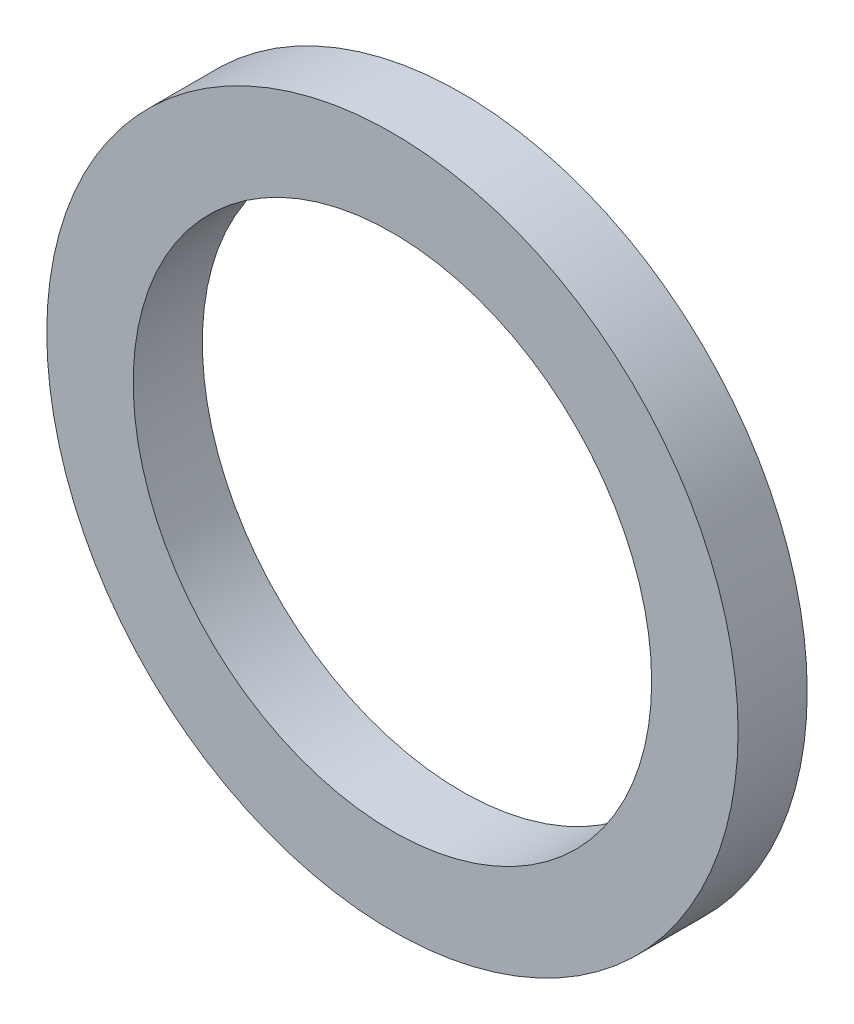
ISO-10303-21;
HEADER;
FILE_DESCRIPTION(('STEP AP214'),'2;1');
FILE_NAME('part.step','',(''),(''),'','','');
FILE_SCHEMA(('AUTOMOTIVE_DESIGN { 1 0 10303 214 1 1 1 1 }'));
ENDSEC;
DATA;
#1=APPLICATION_CONTEXT('core data for automotive mechanical design processes');
#2=APPLICATION_PROTOCOL_DEFINITION('international standard','automotive_design',2000,#1);
#3=PRODUCT_CONTEXT('',#1,'mechanical');
#4=PRODUCT('Part','Part','',(#3));
#5=PRODUCT_RELATED_PRODUCT_CATEGORY('part','',(#4));
#6=PRODUCT_DEFINITION_FORMATION('','',#4);
#7=PRODUCT_DEFINITION_CONTEXT('part definition',#1,'design');
#8=PRODUCT_DEFINITION('design','',#6,#7);
#9=PRODUCT_DEFINITION_SHAPE('','',#8);
#10=(LENGTH_UNIT() NAMED_UNIT(*) SI_UNIT(.MILLI.,.METRE.));
#11=(NAMED_UNIT(*) PLANE_ANGLE_UNIT() SI_UNIT($,.RADIAN.));
#12=(NAMED_UNIT(*) SI_UNIT($,.STERADIAN.) SOLID_ANGLE_UNIT());
#13=UNCERTAINTY_MEASURE_WITH_UNIT(LENGTH_MEASURE(1.E-05),#10,'distance_accuracy_value','');
#14=(GEOMETRIC_REPRESENTATION_CONTEXT(3) GLOBAL_UNCERTAINTY_ASSIGNED_CONTEXT((#13)) GLOBAL_UNIT_ASSIGNED_CONTEXT((#10,
#11,#12)) REPRESENTATION_CONTEXT('',''));
#15=CARTESIAN_POINT('',(0.,0.,0.));
#16=DIRECTION('',(0.,0.,1.));
#17=DIRECTION('',(1.,0.,0.));
#18=AXIS2_PLACEMENT_3D('',#15,#16,#17);
#19=CARTESIAN_POINT('',(0.,21.4612565054705,1.27));
#20=DIRECTION('',(0.,0.,1.));
#21=DIRECTION('',(1.,0.,0.));
#22=AXIS2_PLACEMENT_3D('',#19,#20,#21);
#23=PLANE('',#22);
#24=CARTESIAN_POINT('',(0.,21.4612565054705,1.27));
#25=DIRECTION('',(0.,0.,1.));
#26=DIRECTION('',(1.,0.,0.));
#27=AXIS2_PLACEMENT_3D('',#24,#25,#26);
#28=CIRCLE('',#27,6.35000000000013);
#29=CARTESIAN_POINT('',(6.35000000000018,21.4612565054705,1.27));
#30=VERTEX_POINT('',#29);
#31=EDGE_CURVE('E10',#30,#30,#28,.T.);
#32=ORIENTED_EDGE('',*,*,#31,.T.);
#33=EDGE_LOOP('',(#32));
#34=FACE_BOUND('',#33,.T.);
#35=CARTESIAN_POINT('',(0.,21.4612565054705,1.27));
#36=DIRECTION('',(0.,0.,1.));
#37=DIRECTION('',(1.,0.,0.));
#38=AXIS2_PLACEMENT_3D('',#35,#36,#37);
#39=CIRCLE('',#38,4.76250000000011);
#40=CARTESIAN_POINT('',(4.76250000000017,21.4612565054705,1.27));
#41=VERTEX_POINT('',#40);
#42=EDGE_CURVE('E52',#41,#41,#39,.T.);
#43=ORIENTED_EDGE('',*,*,#42,.F.);
#44=EDGE_LOOP('',(#43));
#45=FACE_BOUND('',#44,.T.);
#46=ADVANCED_FACE('F41',(#34,#45),#23,.T.);
#47=CARTESIAN_POINT('',(0.,21.4612565054705,0.));
#48=DIRECTION('',(0.,0.,1.));
#49=DIRECTION('',(1.,0.,0.));
#50=AXIS2_PLACEMENT_3D('',#47,#48,#49);
#51=PLANE('',#50);
#52=CARTESIAN_POINT('',(0.,21.4612565054705,0.));
#53=DIRECTION('',(0.,0.,1.));
#54=DIRECTION('',(1.,0.,0.));
#55=AXIS2_PLACEMENT_3D('',#52,#53,#54);
#56=CIRCLE('',#55,6.35000000000013);
#57=CARTESIAN_POINT('',(6.35000000000018,21.4612565054705,0.));
#58=VERTEX_POINT('',#57);
#59=EDGE_CURVE('E45',#58,#58,#56,.T.);
#60=ORIENTED_EDGE('',*,*,#59,.F.);
#61=EDGE_LOOP('',(#60));
#62=FACE_BOUND('',#61,.T.);
#63=CARTESIAN_POINT('',(0.,21.4612565054705,0.));
#64=DIRECTION('',(0.,0.,1.));
#65=DIRECTION('',(1.,0.,0.));
#66=AXIS2_PLACEMENT_3D('',#63,#64,#65);
#67=CIRCLE('',#66,4.76250000000011);
#68=CARTESIAN_POINT('',(4.76250000000017,21.4612565054705,0.));
#69=VERTEX_POINT('',#68);
#70=EDGE_CURVE('E54',#69,#69,#67,.T.);
#71=ORIENTED_EDGE('',*,*,#70,.T.);
#72=EDGE_LOOP('',(#71));
#73=FACE_BOUND('',#72,.T.);
#74=ADVANCED_FACE('F64',(#62,#73),#51,.F.);
#75=CARTESIAN_POINT('',(0.,21.4612565054705,1.27));
#76=DIRECTION('',(0.,0.,-1.));
#77=DIRECTION('',(-1.,0.,0.));
#78=AXIS2_PLACEMENT_3D('',#75,#76,#77);
#79=CYLINDRICAL_SURFACE('',#78,6.35000000000013);
#80=ORIENTED_EDGE('',*,*,#31,.F.);
#81=EDGE_LOOP('',(#80));
#82=FACE_BOUND('',#81,.T.);
#83=ORIENTED_EDGE('',*,*,#59,.T.);
#84=EDGE_LOOP('',(#83));
#85=FACE_BOUND('',#84,.T.);
#86=ADVANCED_FACE('F43',(#82,#85),#79,.T.);
#87=CARTESIAN_POINT('',(0.,21.4612565054705,1.27));
#88=DIRECTION('',(0.,0.,-1.));
#89=DIRECTION('',(-1.,0.,0.));
#90=AXIS2_PLACEMENT_3D('',#87,#88,#89);
#91=CYLINDRICAL_SURFACE('',#90,4.76250000000011);
#92=ORIENTED_EDGE('',*,*,#42,.T.);
#93=EDGE_LOOP('',(#92));
#94=FACE_BOUND('',#93,.T.);
#95=ORIENTED_EDGE('',*,*,#70,.F.);
#96=EDGE_LOOP('',(#95));
#97=FACE_BOUND('',#96,.T.);
#98=ADVANCED_FACE('F60',(#94,#97),#91,.F.);
#99=CLOSED_SHELL('',(#46,#74,#86,#98));
#100=MANIFOLD_SOLID_BREP('B2',#99);
#101=ADVANCED_BREP_SHAPE_REPRESENTATION('',(#18,#100),#14);
#102=SHAPE_DEFINITION_REPRESENTATION(#9,#101);
ENDSEC;
END-ISO-10303-21;
